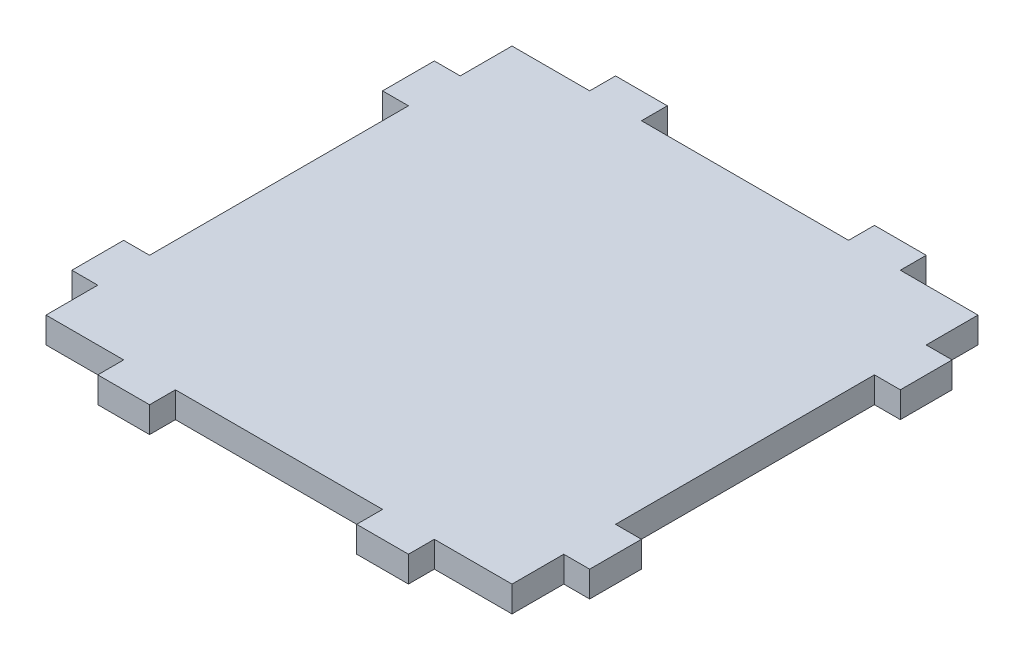
ISO-10303-21;
HEADER;
FILE_DESCRIPTION(('STEP AP214'),'2;1');
FILE_NAME('part.step','',(''),(''),'','','');
FILE_SCHEMA(('AUTOMOTIVE_DESIGN { 1 0 10303 214 1 1 1 1 }'));
ENDSEC;
DATA;
#1=APPLICATION_CONTEXT('core data for automotive mechanical design processes');
#2=APPLICATION_PROTOCOL_DEFINITION('international standard','automotive_design',2000,#1);
#3=PRODUCT_CONTEXT('',#1,'mechanical');
#4=PRODUCT('Part','Part','',(#3));
#5=PRODUCT_RELATED_PRODUCT_CATEGORY('part','',(#4));
#6=PRODUCT_DEFINITION_FORMATION('','',#4);
#7=PRODUCT_DEFINITION_CONTEXT('part definition',#1,'design');
#8=PRODUCT_DEFINITION('design','',#6,#7);
#9=PRODUCT_DEFINITION_SHAPE('','',#8);
#10=(LENGTH_UNIT() NAMED_UNIT(*) SI_UNIT(.MILLI.,.METRE.));
#11=(NAMED_UNIT(*) PLANE_ANGLE_UNIT() SI_UNIT($,.RADIAN.));
#12=(NAMED_UNIT(*) SI_UNIT($,.STERADIAN.) SOLID_ANGLE_UNIT());
#13=UNCERTAINTY_MEASURE_WITH_UNIT(LENGTH_MEASURE(1.E-05),#10,'distance_accuracy_value','');
#14=(GEOMETRIC_REPRESENTATION_CONTEXT(3) GLOBAL_UNCERTAINTY_ASSIGNED_CONTEXT((#13)) GLOBAL_UNIT_ASSIGNED_CONTEXT((#10,
#11,#12)) REPRESENTATION_CONTEXT('',''));
#15=CARTESIAN_POINT('',(0.,0.,0.));
#16=DIRECTION('',(0.,0.,1.));
#17=DIRECTION('',(1.,0.,0.));
#18=AXIS2_PLACEMENT_3D('',#15,#16,#17);
#19=CARTESIAN_POINT('',(45.,5.,45.));
#20=DIRECTION('',(-1.,0.,0.));
#21=DIRECTION('',(0.,0.,1.));
#22=AXIS2_PLACEMENT_3D('',#19,#20,#21);
#23=PLANE('',#22);
#24=DIRECTION('',(0.,0.,-1.));
#25=VECTOR('',#24,1.);
#26=CARTESIAN_POINT('',(45.,0.,45.));
#27=LINE('',#26,#25);
#28=CARTESIAN_POINT('',(45.,0.,45.));
#29=VERTEX_POINT('',#28);
#30=CARTESIAN_POINT('',(45.,0.,35.));
#31=VERTEX_POINT('',#30);
#32=EDGE_CURVE('E305',#29,#31,#27,.T.);
#33=ORIENTED_EDGE('',*,*,#32,.T.);
#34=DIRECTION('',(0.,-1.,0.));
#35=VECTOR('',#34,1.);
#36=CARTESIAN_POINT('',(45.,5.,35.));
#37=LINE('',#36,#35);
#38=CARTESIAN_POINT('',(45.,5.,35.));
#39=VERTEX_POINT('',#38);
#40=EDGE_CURVE('E11',#39,#31,#37,.T.);
#41=ORIENTED_EDGE('',*,*,#40,.F.);
#42=DIRECTION('',(0.,0.,-1.));
#43=VECTOR('',#42,1.);
#44=CARTESIAN_POINT('',(45.,5.,45.));
#45=LINE('',#44,#43);
#46=CARTESIAN_POINT('',(45.,5.,45.));
#47=VERTEX_POINT('',#46);
#48=EDGE_CURVE('E375',#47,#39,#45,.T.);
#49=ORIENTED_EDGE('',*,*,#48,.F.);
#50=DIRECTION('',(0.,-1.,0.));
#51=VECTOR('',#50,1.);
#52=CARTESIAN_POINT('',(45.,5.,45.));
#53=LINE('',#52,#51);
#54=EDGE_CURVE('E301',#47,#29,#53,.T.);
#55=ORIENTED_EDGE('',*,*,#54,.T.);
#56=EDGE_LOOP('',(#33,#41,#49,#55));
#57=FACE_BOUND('',#56,.T.);
#58=ADVANCED_FACE('F41',(#57),#23,.F.);
#59=CARTESIAN_POINT('',(45.,5.,35.));
#60=DIRECTION('',(0.,0.,-1.));
#61=DIRECTION('',(-1.,0.,0.));
#62=AXIS2_PLACEMENT_3D('',#59,#60,#61);
#63=PLANE('',#62);
#64=DIRECTION('',(1.,0.,0.));
#65=VECTOR('',#64,1.);
#66=CARTESIAN_POINT('',(45.,0.,35.));
#67=LINE('',#66,#65);
#68=CARTESIAN_POINT('',(50.,0.,35.));
#69=VERTEX_POINT('',#68);
#70=EDGE_CURVE('E308',#31,#69,#67,.T.);
#71=ORIENTED_EDGE('',*,*,#70,.T.);
#72=DIRECTION('',(0.,-1.,0.));
#73=VECTOR('',#72,1.);
#74=CARTESIAN_POINT('',(50.,5.,35.));
#75=LINE('',#74,#73);
#76=CARTESIAN_POINT('',(50.,5.,35.));
#77=VERTEX_POINT('',#76);
#78=EDGE_CURVE('E49',#77,#69,#75,.T.);
#79=ORIENTED_EDGE('',*,*,#78,.F.);
#80=DIRECTION('',(1.,0.,0.));
#81=VECTOR('',#80,1.);
#82=CARTESIAN_POINT('',(45.,5.,35.));
#83=LINE('',#82,#81);
#84=EDGE_CURVE('E184',#39,#77,#83,.T.);
#85=ORIENTED_EDGE('',*,*,#84,.F.);
#86=ORIENTED_EDGE('',*,*,#40,.T.);
#87=EDGE_LOOP('',(#71,#79,#85,#86));
#88=FACE_BOUND('',#87,.T.);
#89=ADVANCED_FACE('F573',(#88),#63,.F.);
#90=CARTESIAN_POINT('',(50.,5.,35.));
#91=DIRECTION('',(-1.,0.,0.));
#92=DIRECTION('',(0.,0.,1.));
#93=AXIS2_PLACEMENT_3D('',#90,#91,#92);
#94=PLANE('',#93);
#95=DIRECTION('',(0.,0.,-1.));
#96=VECTOR('',#95,1.);
#97=CARTESIAN_POINT('',(50.,0.,35.));
#98=LINE('',#97,#96);
#99=CARTESIAN_POINT('',(50.,0.,25.));
#100=VERTEX_POINT('',#99);
#101=EDGE_CURVE('E310',#69,#100,#98,.T.);
#102=ORIENTED_EDGE('',*,*,#101,.T.);
#103=DIRECTION('',(0.,-1.,0.));
#104=VECTOR('',#103,1.);
#105=CARTESIAN_POINT('',(50.,5.,25.));
#106=LINE('',#105,#104);
#107=CARTESIAN_POINT('',(50.,5.,25.));
#108=VERTEX_POINT('',#107);
#109=EDGE_CURVE('E466',#108,#100,#106,.T.);
#110=ORIENTED_EDGE('',*,*,#109,.F.);
#111=DIRECTION('',(0.,0.,-1.));
#112=VECTOR('',#111,1.);
#113=CARTESIAN_POINT('',(50.,5.,35.));
#114=LINE('',#113,#112);
#115=EDGE_CURVE('E474',#77,#108,#114,.T.);
#116=ORIENTED_EDGE('',*,*,#115,.F.);
#117=ORIENTED_EDGE('',*,*,#78,.T.);
#118=EDGE_LOOP('',(#102,#110,#116,#117));
#119=FACE_BOUND('',#118,.T.);
#120=ADVANCED_FACE('F472',(#119),#94,.F.);
#121=CARTESIAN_POINT('',(45.,5.,25.));
#122=DIRECTION('',(0.,0.,1.));
#123=DIRECTION('',(1.,0.,0.));
#124=AXIS2_PLACEMENT_3D('',#121,#122,#123);
#125=PLANE('',#124);
#126=DIRECTION('',(-1.,0.,0.));
#127=VECTOR('',#126,1.);
#128=CARTESIAN_POINT('',(45.,0.,25.));
#129=LINE('',#128,#127);
#130=CARTESIAN_POINT('',(45.,0.,25.));
#131=VERTEX_POINT('',#130);
#132=EDGE_CURVE('E312',#100,#131,#129,.T.);
#133=ORIENTED_EDGE('',*,*,#132,.T.);
#134=DIRECTION('',(0.,-1.,0.));
#135=VECTOR('',#134,1.);
#136=CARTESIAN_POINT('',(45.,5.,25.));
#137=LINE('',#136,#135);
#138=CARTESIAN_POINT('',(45.,5.,25.));
#139=VERTEX_POINT('',#138);
#140=EDGE_CURVE('E463',#139,#131,#137,.T.);
#141=ORIENTED_EDGE('',*,*,#140,.F.);
#142=DIRECTION('',(-1.,0.,0.));
#143=VECTOR('',#142,1.);
#144=CARTESIAN_POINT('',(45.,5.,25.));
#145=LINE('',#144,#143);
#146=EDGE_CURVE('E492',#108,#139,#145,.T.);
#147=ORIENTED_EDGE('',*,*,#146,.F.);
#148=ORIENTED_EDGE('',*,*,#109,.T.);
#149=EDGE_LOOP('',(#133,#141,#147,#148));
#150=FACE_BOUND('',#149,.T.);
#151=ADVANCED_FACE('F483',(#150),#125,.F.);
#152=CARTESIAN_POINT('',(45.,5.,-25.));
#153=DIRECTION('',(-1.,0.,0.));
#154=DIRECTION('',(0.,0.,1.));
#155=AXIS2_PLACEMENT_3D('',#152,#153,#154);
#156=PLANE('',#155);
#157=DIRECTION('',(0.,0.,-1.));
#158=VECTOR('',#157,1.);
#159=CARTESIAN_POINT('',(45.,0.,-25.));
#160=LINE('',#159,#158);
#161=CARTESIAN_POINT('',(45.,0.,-25.));
#162=VERTEX_POINT('',#161);
#163=EDGE_CURVE('E314',#131,#162,#160,.T.);
#164=ORIENTED_EDGE('',*,*,#163,.T.);
#165=DIRECTION('',(0.,-1.,0.));
#166=VECTOR('',#165,1.);
#167=CARTESIAN_POINT('',(45.,5.,-25.));
#168=LINE('',#167,#166);
#169=CARTESIAN_POINT('',(45.,5.,-25.));
#170=VERTEX_POINT('',#169);
#171=EDGE_CURVE('E460',#170,#162,#168,.T.);
#172=ORIENTED_EDGE('',*,*,#171,.F.);
#173=DIRECTION('',(0.,0.,-1.));
#174=VECTOR('',#173,1.);
#175=CARTESIAN_POINT('',(45.,5.,-25.));
#176=LINE('',#175,#174);
#177=EDGE_CURVE('E489',#139,#170,#176,.T.);
#178=ORIENTED_EDGE('',*,*,#177,.F.);
#179=ORIENTED_EDGE('',*,*,#140,.T.);
#180=EDGE_LOOP('',(#164,#172,#178,#179));
#181=FACE_BOUND('',#180,.T.);
#182=ADVANCED_FACE('F487',(#181),#156,.F.);
#183=CARTESIAN_POINT('',(45.,5.,-25.));
#184=DIRECTION('',(0.,0.,-1.));
#185=DIRECTION('',(-1.,0.,0.));
#186=AXIS2_PLACEMENT_3D('',#183,#184,#185);
#187=PLANE('',#186);
#188=DIRECTION('',(1.,0.,0.));
#189=VECTOR('',#188,1.);
#190=CARTESIAN_POINT('',(45.,0.,-25.));
#191=LINE('',#190,#189);
#192=CARTESIAN_POINT('',(50.,0.,-25.));
#193=VERTEX_POINT('',#192);
#194=EDGE_CURVE('E316',#162,#193,#191,.T.);
#195=ORIENTED_EDGE('',*,*,#194,.T.);
#196=DIRECTION('',(0.,-1.,0.));
#197=VECTOR('',#196,1.);
#198=CARTESIAN_POINT('',(50.,5.,-25.));
#199=LINE('',#198,#197);
#200=CARTESIAN_POINT('',(50.,5.,-25.));
#201=VERTEX_POINT('',#200);
#202=EDGE_CURVE('E457',#201,#193,#199,.T.);
#203=ORIENTED_EDGE('',*,*,#202,.F.);
#204=DIRECTION('',(1.,0.,0.));
#205=VECTOR('',#204,1.);
#206=CARTESIAN_POINT('',(45.,5.,-25.));
#207=LINE('',#206,#205);
#208=EDGE_CURVE('E491',#170,#201,#207,.T.);
#209=ORIENTED_EDGE('',*,*,#208,.F.);
#210=ORIENTED_EDGE('',*,*,#171,.T.);
#211=EDGE_LOOP('',(#195,#203,#209,#210));
#212=FACE_BOUND('',#211,.T.);
#213=ADVANCED_FACE('F586',(#212),#187,.F.);
#214=CARTESIAN_POINT('',(50.,5.,-35.));
#215=DIRECTION('',(-1.,0.,0.));
#216=DIRECTION('',(0.,0.,1.));
#217=AXIS2_PLACEMENT_3D('',#214,#215,#216);
#218=PLANE('',#217);
#219=DIRECTION('',(0.,0.,-1.));
#220=VECTOR('',#219,1.);
#221=CARTESIAN_POINT('',(50.,0.,-35.));
#222=LINE('',#221,#220);
#223=CARTESIAN_POINT('',(50.,0.,-35.));
#224=VERTEX_POINT('',#223);
#225=EDGE_CURVE('E318',#193,#224,#222,.T.);
#226=ORIENTED_EDGE('',*,*,#225,.T.);
#227=DIRECTION('',(0.,-1.,0.));
#228=VECTOR('',#227,1.);
#229=CARTESIAN_POINT('',(50.,5.,-35.));
#230=LINE('',#229,#228);
#231=CARTESIAN_POINT('',(50.,5.,-35.));
#232=VERTEX_POINT('',#231);
#233=EDGE_CURVE('E454',#232,#224,#230,.T.);
#234=ORIENTED_EDGE('',*,*,#233,.F.);
#235=DIRECTION('',(0.,0.,-1.));
#236=VECTOR('',#235,1.);
#237=CARTESIAN_POINT('',(50.,5.,-35.));
#238=LINE('',#237,#236);
#239=EDGE_CURVE('E494',#201,#232,#238,.T.);
#240=ORIENTED_EDGE('',*,*,#239,.F.);
#241=ORIENTED_EDGE('',*,*,#202,.T.);
#242=EDGE_LOOP('',(#226,#234,#240,#241));
#243=FACE_BOUND('',#242,.T.);
#244=ADVANCED_FACE('F589',(#243),#218,.F.);
#245=CARTESIAN_POINT('',(45.,5.,-35.));
#246=DIRECTION('',(0.,0.,1.));
#247=DIRECTION('',(1.,0.,0.));
#248=AXIS2_PLACEMENT_3D('',#245,#246,#247);
#249=PLANE('',#248);
#250=DIRECTION('',(-1.,0.,0.));
#251=VECTOR('',#250,1.);
#252=CARTESIAN_POINT('',(45.,0.,-35.));
#253=LINE('',#252,#251);
#254=CARTESIAN_POINT('',(45.,0.,-35.));
#255=VERTEX_POINT('',#254);
#256=EDGE_CURVE('E320',#224,#255,#253,.T.);
#257=ORIENTED_EDGE('',*,*,#256,.T.);
#258=DIRECTION('',(0.,-1.,0.));
#259=VECTOR('',#258,1.);
#260=CARTESIAN_POINT('',(45.,5.,-35.));
#261=LINE('',#260,#259);
#262=CARTESIAN_POINT('',(45.,5.,-35.));
#263=VERTEX_POINT('',#262);
#264=EDGE_CURVE('E451',#263,#255,#261,.T.);
#265=ORIENTED_EDGE('',*,*,#264,.F.);
#266=DIRECTION('',(-1.,0.,0.));
#267=VECTOR('',#266,1.);
#268=CARTESIAN_POINT('',(45.,5.,-35.));
#269=LINE('',#268,#267);
#270=EDGE_CURVE('E500',#232,#263,#269,.T.);
#271=ORIENTED_EDGE('',*,*,#270,.F.);
#272=ORIENTED_EDGE('',*,*,#233,.T.);
#273=EDGE_LOOP('',(#257,#265,#271,#272));
#274=FACE_BOUND('',#273,.T.);
#275=ADVANCED_FACE('F593',(#274),#249,.F.);
#276=CARTESIAN_POINT('',(45.,5.,-45.));
#277=DIRECTION('',(-1.,0.,0.));
#278=DIRECTION('',(0.,0.,1.));
#279=AXIS2_PLACEMENT_3D('',#276,#277,#278);
#280=PLANE('',#279);
#281=DIRECTION('',(0.,0.,-1.));
#282=VECTOR('',#281,1.);
#283=CARTESIAN_POINT('',(45.,0.,-45.));
#284=LINE('',#283,#282);
#285=CARTESIAN_POINT('',(45.,0.,-45.));
#286=VERTEX_POINT('',#285);
#287=EDGE_CURVE('E322',#255,#286,#284,.T.);
#288=ORIENTED_EDGE('',*,*,#287,.T.);
#289=DIRECTION('',(0.,-1.,0.));
#290=VECTOR('',#289,1.);
#291=CARTESIAN_POINT('',(45.,5.,-45.));
#292=LINE('',#291,#290);
#293=CARTESIAN_POINT('',(45.,5.,-45.));
#294=VERTEX_POINT('',#293);
#295=EDGE_CURVE('E448',#294,#286,#292,.T.);
#296=ORIENTED_EDGE('',*,*,#295,.F.);
#297=DIRECTION('',(0.,0.,-1.));
#298=VECTOR('',#297,1.);
#299=CARTESIAN_POINT('',(45.,5.,-45.));
#300=LINE('',#299,#298);
#301=EDGE_CURVE('E502',#263,#294,#300,.T.);
#302=ORIENTED_EDGE('',*,*,#301,.F.);
#303=ORIENTED_EDGE('',*,*,#264,.T.);
#304=EDGE_LOOP('',(#288,#296,#302,#303));
#305=FACE_BOUND('',#304,.T.);
#306=ADVANCED_FACE('F597',(#305),#280,.F.);
#307=CARTESIAN_POINT('',(45.,5.,-45.));
#308=DIRECTION('',(0.,0.,1.));
#309=DIRECTION('',(1.,0.,0.));
#310=AXIS2_PLACEMENT_3D('',#307,#308,#309);
#311=PLANE('',#310);
#312=DIRECTION('',(-1.,0.,0.));
#313=VECTOR('',#312,1.);
#314=CARTESIAN_POINT('',(45.,0.,-45.));
#315=LINE('',#314,#313);
#316=CARTESIAN_POINT('',(30.,0.,-45.));
#317=VERTEX_POINT('',#316);
#318=EDGE_CURVE('E324',#286,#317,#315,.T.);
#319=ORIENTED_EDGE('',*,*,#318,.T.);
#320=DIRECTION('',(0.,-1.,0.));
#321=VECTOR('',#320,1.);
#322=CARTESIAN_POINT('',(30.,5.,-45.));
#323=LINE('',#322,#321);
#324=CARTESIAN_POINT('',(30.,5.,-45.));
#325=VERTEX_POINT('',#324);
#326=EDGE_CURVE('E445',#325,#317,#323,.T.);
#327=ORIENTED_EDGE('',*,*,#326,.F.);
#328=DIRECTION('',(-1.,0.,0.));
#329=VECTOR('',#328,1.);
#330=CARTESIAN_POINT('',(45.,5.,-45.));
#331=LINE('',#330,#329);
#332=EDGE_CURVE('E504',#294,#325,#331,.T.);
#333=ORIENTED_EDGE('',*,*,#332,.F.);
#334=ORIENTED_EDGE('',*,*,#295,.T.);
#335=EDGE_LOOP('',(#319,#327,#333,#334));
#336=FACE_BOUND('',#335,.T.);
#337=ADVANCED_FACE('F601',(#336),#311,.F.);
#338=CARTESIAN_POINT('',(30.,5.,-45.));
#339=DIRECTION('',(-1.,0.,0.));
#340=DIRECTION('',(0.,0.,1.));
#341=AXIS2_PLACEMENT_3D('',#338,#339,#340);
#342=PLANE('',#341);
#343=DIRECTION('',(0.,0.,-1.));
#344=VECTOR('',#343,1.);
#345=CARTESIAN_POINT('',(30.,0.,-45.));
#346=LINE('',#345,#344);
#347=CARTESIAN_POINT('',(30.,0.,-50.));
#348=VERTEX_POINT('',#347);
#349=EDGE_CURVE('E326',#317,#348,#346,.T.);
#350=ORIENTED_EDGE('',*,*,#349,.T.);
#351=DIRECTION('',(0.,-1.,0.));
#352=VECTOR('',#351,1.);
#353=CARTESIAN_POINT('',(30.,5.,-50.));
#354=LINE('',#353,#352);
#355=CARTESIAN_POINT('',(30.,5.,-50.));
#356=VERTEX_POINT('',#355);
#357=EDGE_CURVE('E442',#356,#348,#354,.T.);
#358=ORIENTED_EDGE('',*,*,#357,.F.);
#359=DIRECTION('',(0.,0.,-1.));
#360=VECTOR('',#359,1.);
#361=CARTESIAN_POINT('',(30.,5.,-45.));
#362=LINE('',#361,#360);
#363=EDGE_CURVE('E506',#325,#356,#362,.T.);
#364=ORIENTED_EDGE('',*,*,#363,.F.);
#365=ORIENTED_EDGE('',*,*,#326,.T.);
#366=EDGE_LOOP('',(#350,#358,#364,#365));
#367=FACE_BOUND('',#366,.T.);
#368=ADVANCED_FACE('F605',(#367),#342,.F.);
#369=CARTESIAN_POINT('',(30.,5.,-50.));
#370=DIRECTION('',(0.,0.,1.));
#371=DIRECTION('',(1.,0.,0.));
#372=AXIS2_PLACEMENT_3D('',#369,#370,#371);
#373=PLANE('',#372);
#374=DIRECTION('',(-1.,0.,0.));
#375=VECTOR('',#374,1.);
#376=CARTESIAN_POINT('',(30.,0.,-50.));
#377=LINE('',#376,#375);
#378=CARTESIAN_POINT('',(20.,0.,-50.));
#379=VERTEX_POINT('',#378);
#380=EDGE_CURVE('E328',#348,#379,#377,.T.);
#381=ORIENTED_EDGE('',*,*,#380,.T.);
#382=DIRECTION('',(0.,-1.,0.));
#383=VECTOR('',#382,1.);
#384=CARTESIAN_POINT('',(20.,5.,-50.));
#385=LINE('',#384,#383);
#386=CARTESIAN_POINT('',(20.,5.,-50.));
#387=VERTEX_POINT('',#386);
#388=EDGE_CURVE('E439',#387,#379,#385,.T.);
#389=ORIENTED_EDGE('',*,*,#388,.F.);
#390=DIRECTION('',(-1.,0.,0.));
#391=VECTOR('',#390,1.);
#392=CARTESIAN_POINT('',(30.,5.,-50.));
#393=LINE('',#392,#391);
#394=EDGE_CURVE('E508',#356,#387,#393,.T.);
#395=ORIENTED_EDGE('',*,*,#394,.F.);
#396=ORIENTED_EDGE('',*,*,#357,.T.);
#397=EDGE_LOOP('',(#381,#389,#395,#396));
#398=FACE_BOUND('',#397,.T.);
#399=ADVANCED_FACE('F609',(#398),#373,.F.);
#400=CARTESIAN_POINT('',(20.,5.,-45.));
#401=DIRECTION('',(1.,0.,0.));
#402=DIRECTION('',(0.,0.,-1.));
#403=AXIS2_PLACEMENT_3D('',#400,#401,#402);
#404=PLANE('',#403);
#405=DIRECTION('',(0.,0.,1.));
#406=VECTOR('',#405,1.);
#407=CARTESIAN_POINT('',(20.,0.,-45.));
#408=LINE('',#407,#406);
#409=CARTESIAN_POINT('',(20.,0.,-45.));
#410=VERTEX_POINT('',#409);
#411=EDGE_CURVE('E330',#379,#410,#408,.T.);
#412=ORIENTED_EDGE('',*,*,#411,.T.);
#413=DIRECTION('',(0.,-1.,0.));
#414=VECTOR('',#413,1.);
#415=CARTESIAN_POINT('',(20.,5.,-45.));
#416=LINE('',#415,#414);
#417=CARTESIAN_POINT('',(20.,5.,-45.));
#418=VERTEX_POINT('',#417);
#419=EDGE_CURVE('E436',#418,#410,#416,.T.);
#420=ORIENTED_EDGE('',*,*,#419,.F.);
#421=DIRECTION('',(0.,0.,1.));
#422=VECTOR('',#421,1.);
#423=CARTESIAN_POINT('',(20.,5.,-45.));
#424=LINE('',#423,#422);
#425=EDGE_CURVE('E510',#387,#418,#424,.T.);
#426=ORIENTED_EDGE('',*,*,#425,.F.);
#427=ORIENTED_EDGE('',*,*,#388,.T.);
#428=EDGE_LOOP('',(#412,#420,#426,#427));
#429=FACE_BOUND('',#428,.T.);
#430=ADVANCED_FACE('F613',(#429),#404,.F.);
#431=CARTESIAN_POINT('',(-20.,5.,-45.));
#432=DIRECTION('',(0.,0.,1.));
#433=DIRECTION('',(1.,0.,0.));
#434=AXIS2_PLACEMENT_3D('',#431,#432,#433);
#435=PLANE('',#434);
#436=DIRECTION('',(-1.,0.,0.));
#437=VECTOR('',#436,1.);
#438=CARTESIAN_POINT('',(-20.,0.,-45.));
#439=LINE('',#438,#437);
#440=CARTESIAN_POINT('',(-20.,0.,-45.));
#441=VERTEX_POINT('',#440);
#442=EDGE_CURVE('E332',#410,#441,#439,.T.);
#443=ORIENTED_EDGE('',*,*,#442,.T.);
#444=DIRECTION('',(0.,-1.,0.));
#445=VECTOR('',#444,1.);
#446=CARTESIAN_POINT('',(-20.,5.,-45.));
#447=LINE('',#446,#445);
#448=CARTESIAN_POINT('',(-20.,5.,-45.));
#449=VERTEX_POINT('',#448);
#450=EDGE_CURVE('E433',#449,#441,#447,.T.);
#451=ORIENTED_EDGE('',*,*,#450,.F.);
#452=DIRECTION('',(-1.,0.,0.));
#453=VECTOR('',#452,1.);
#454=CARTESIAN_POINT('',(-20.,5.,-45.));
#455=LINE('',#454,#453);
#456=EDGE_CURVE('E512',#418,#449,#455,.T.);
#457=ORIENTED_EDGE('',*,*,#456,.F.);
#458=ORIENTED_EDGE('',*,*,#419,.T.);
#459=EDGE_LOOP('',(#443,#451,#457,#458));
#460=FACE_BOUND('',#459,.T.);
#461=ADVANCED_FACE('F617',(#460),#435,.F.);
#462=CARTESIAN_POINT('',(-20.,5.,-45.));
#463=DIRECTION('',(-1.,0.,0.));
#464=DIRECTION('',(0.,0.,1.));
#465=AXIS2_PLACEMENT_3D('',#462,#463,#464);
#466=PLANE('',#465);
#467=DIRECTION('',(0.,0.,-1.));
#468=VECTOR('',#467,1.);
#469=CARTESIAN_POINT('',(-20.,0.,-45.));
#470=LINE('',#469,#468);
#471=CARTESIAN_POINT('',(-20.,0.,-50.));
#472=VERTEX_POINT('',#471);
#473=EDGE_CURVE('E334',#441,#472,#470,.T.);
#474=ORIENTED_EDGE('',*,*,#473,.T.);
#475=DIRECTION('',(0.,-1.,0.));
#476=VECTOR('',#475,1.);
#477=CARTESIAN_POINT('',(-20.,5.,-50.));
#478=LINE('',#477,#476);
#479=CARTESIAN_POINT('',(-20.,5.,-50.));
#480=VERTEX_POINT('',#479);
#481=EDGE_CURVE('E430',#480,#472,#478,.T.);
#482=ORIENTED_EDGE('',*,*,#481,.F.);
#483=DIRECTION('',(0.,0.,-1.));
#484=VECTOR('',#483,1.);
#485=CARTESIAN_POINT('',(-20.,5.,-45.));
#486=LINE('',#485,#484);
#487=EDGE_CURVE('E514',#449,#480,#486,.T.);
#488=ORIENTED_EDGE('',*,*,#487,.F.);
#489=ORIENTED_EDGE('',*,*,#450,.T.);
#490=EDGE_LOOP('',(#474,#482,#488,#489));
#491=FACE_BOUND('',#490,.T.);
#492=ADVANCED_FACE('F621',(#491),#466,.F.);
#493=CARTESIAN_POINT('',(-30.,5.,-50.));
#494=DIRECTION('',(0.,0.,1.));
#495=DIRECTION('',(1.,0.,0.));
#496=AXIS2_PLACEMENT_3D('',#493,#494,#495);
#497=PLANE('',#496);
#498=DIRECTION('',(-1.,0.,0.));
#499=VECTOR('',#498,1.);
#500=CARTESIAN_POINT('',(-30.,0.,-50.));
#501=LINE('',#500,#499);
#502=CARTESIAN_POINT('',(-30.,0.,-50.));
#503=VERTEX_POINT('',#502);
#504=EDGE_CURVE('E336',#472,#503,#501,.T.);
#505=ORIENTED_EDGE('',*,*,#504,.T.);
#506=DIRECTION('',(0.,-1.,0.));
#507=VECTOR('',#506,1.);
#508=CARTESIAN_POINT('',(-30.,5.,-50.));
#509=LINE('',#508,#507);
#510=CARTESIAN_POINT('',(-30.,5.,-50.));
#511=VERTEX_POINT('',#510);
#512=EDGE_CURVE('E427',#511,#503,#509,.T.);
#513=ORIENTED_EDGE('',*,*,#512,.F.);
#514=DIRECTION('',(-1.,0.,0.));
#515=VECTOR('',#514,1.);
#516=CARTESIAN_POINT('',(-30.,5.,-50.));
#517=LINE('',#516,#515);
#518=EDGE_CURVE('E516',#480,#511,#517,.T.);
#519=ORIENTED_EDGE('',*,*,#518,.F.);
#520=ORIENTED_EDGE('',*,*,#481,.T.);
#521=EDGE_LOOP('',(#505,#513,#519,#520));
#522=FACE_BOUND('',#521,.T.);
#523=ADVANCED_FACE('F625',(#522),#497,.F.);
#524=CARTESIAN_POINT('',(-30.,5.,-45.));
#525=DIRECTION('',(1.,0.,0.));
#526=DIRECTION('',(0.,0.,-1.));
#527=AXIS2_PLACEMENT_3D('',#524,#525,#526);
#528=PLANE('',#527);
#529=DIRECTION('',(0.,0.,1.));
#530=VECTOR('',#529,1.);
#531=CARTESIAN_POINT('',(-30.,0.,-45.));
#532=LINE('',#531,#530);
#533=CARTESIAN_POINT('',(-30.,0.,-45.));
#534=VERTEX_POINT('',#533);
#535=EDGE_CURVE('E338',#503,#534,#532,.T.);
#536=ORIENTED_EDGE('',*,*,#535,.T.);
#537=DIRECTION('',(0.,-1.,0.));
#538=VECTOR('',#537,1.);
#539=CARTESIAN_POINT('',(-30.,5.,-45.));
#540=LINE('',#539,#538);
#541=CARTESIAN_POINT('',(-30.,5.,-45.));
#542=VERTEX_POINT('',#541);
#543=EDGE_CURVE('E424',#542,#534,#540,.T.);
#544=ORIENTED_EDGE('',*,*,#543,.F.);
#545=DIRECTION('',(0.,0.,1.));
#546=VECTOR('',#545,1.);
#547=CARTESIAN_POINT('',(-30.,5.,-45.));
#548=LINE('',#547,#546);
#549=EDGE_CURVE('E518',#511,#542,#548,.T.);
#550=ORIENTED_EDGE('',*,*,#549,.F.);
#551=ORIENTED_EDGE('',*,*,#512,.T.);
#552=EDGE_LOOP('',(#536,#544,#550,#551));
#553=FACE_BOUND('',#552,.T.);
#554=ADVANCED_FACE('F629',(#553),#528,.F.);
#555=CARTESIAN_POINT('',(-45.,5.,-45.));
#556=DIRECTION('',(0.,0.,1.));
#557=DIRECTION('',(1.,0.,0.));
#558=AXIS2_PLACEMENT_3D('',#555,#556,#557);
#559=PLANE('',#558);
#560=DIRECTION('',(-1.,0.,0.));
#561=VECTOR('',#560,1.);
#562=CARTESIAN_POINT('',(-45.,0.,-45.));
#563=LINE('',#562,#561);
#564=CARTESIAN_POINT('',(-45.,0.,-45.));
#565=VERTEX_POINT('',#564);
#566=EDGE_CURVE('E340',#534,#565,#563,.T.);
#567=ORIENTED_EDGE('',*,*,#566,.T.);
#568=DIRECTION('',(0.,-1.,0.));
#569=VECTOR('',#568,1.);
#570=CARTESIAN_POINT('',(-45.,5.,-45.));
#571=LINE('',#570,#569);
#572=CARTESIAN_POINT('',(-45.,5.,-45.));
#573=VERTEX_POINT('',#572);
#574=EDGE_CURVE('E421',#573,#565,#571,.T.);
#575=ORIENTED_EDGE('',*,*,#574,.F.);
#576=DIRECTION('',(-1.,0.,0.));
#577=VECTOR('',#576,1.);
#578=CARTESIAN_POINT('',(-45.,5.,-45.));
#579=LINE('',#578,#577);
#580=EDGE_CURVE('E520',#542,#573,#579,.T.);
#581=ORIENTED_EDGE('',*,*,#580,.F.);
#582=ORIENTED_EDGE('',*,*,#543,.T.);
#583=EDGE_LOOP('',(#567,#575,#581,#582));
#584=FACE_BOUND('',#583,.T.);
#585=ADVANCED_FACE('F633',(#584),#559,.F.);
#586=CARTESIAN_POINT('',(-45.,5.,-45.));
#587=DIRECTION('',(1.,0.,0.));
#588=DIRECTION('',(0.,0.,-1.));
#589=AXIS2_PLACEMENT_3D('',#586,#587,#588);
#590=PLANE('',#589);
#591=DIRECTION('',(0.,0.,1.));
#592=VECTOR('',#591,1.);
#593=CARTESIAN_POINT('',(-45.,0.,-45.));
#594=LINE('',#593,#592);
#595=CARTESIAN_POINT('',(-45.,0.,-35.));
#596=VERTEX_POINT('',#595);
#597=EDGE_CURVE('E342',#565,#596,#594,.T.);
#598=ORIENTED_EDGE('',*,*,#597,.T.);
#599=DIRECTION('',(0.,-1.,0.));
#600=VECTOR('',#599,1.);
#601=CARTESIAN_POINT('',(-45.,5.,-35.));
#602=LINE('',#601,#600);
#603=CARTESIAN_POINT('',(-45.,5.,-35.));
#604=VERTEX_POINT('',#603);
#605=EDGE_CURVE('E418',#604,#596,#602,.T.);
#606=ORIENTED_EDGE('',*,*,#605,.F.);
#607=DIRECTION('',(0.,0.,1.));
#608=VECTOR('',#607,1.);
#609=CARTESIAN_POINT('',(-45.,5.,-45.));
#610=LINE('',#609,#608);
#611=EDGE_CURVE('E522',#573,#604,#610,.T.);
#612=ORIENTED_EDGE('',*,*,#611,.F.);
#613=ORIENTED_EDGE('',*,*,#574,.T.);
#614=EDGE_LOOP('',(#598,#606,#612,#613));
#615=FACE_BOUND('',#614,.T.);
#616=ADVANCED_FACE('F637',(#615),#590,.F.);
#617=CARTESIAN_POINT('',(-45.,5.,-35.));
#618=DIRECTION('',(0.,0.,1.));
#619=DIRECTION('',(1.,0.,0.));
#620=AXIS2_PLACEMENT_3D('',#617,#618,#619);
#621=PLANE('',#620);
#622=DIRECTION('',(-1.,0.,0.));
#623=VECTOR('',#622,1.);
#624=CARTESIAN_POINT('',(-45.,0.,-35.));
#625=LINE('',#624,#623);
#626=CARTESIAN_POINT('',(-50.,0.,-35.));
#627=VERTEX_POINT('',#626);
#628=EDGE_CURVE('E344',#596,#627,#625,.T.);
#629=ORIENTED_EDGE('',*,*,#628,.T.);
#630=DIRECTION('',(0.,-1.,0.));
#631=VECTOR('',#630,1.);
#632=CARTESIAN_POINT('',(-50.,5.,-35.));
#633=LINE('',#632,#631);
#634=CARTESIAN_POINT('',(-50.,5.,-35.));
#635=VERTEX_POINT('',#634);
#636=EDGE_CURVE('E415',#635,#627,#633,.T.);
#637=ORIENTED_EDGE('',*,*,#636,.F.);
#638=DIRECTION('',(-1.,0.,0.));
#639=VECTOR('',#638,1.);
#640=CARTESIAN_POINT('',(-45.,5.,-35.));
#641=LINE('',#640,#639);
#642=EDGE_CURVE('E524',#604,#635,#641,.T.);
#643=ORIENTED_EDGE('',*,*,#642,.F.);
#644=ORIENTED_EDGE('',*,*,#605,.T.);
#645=EDGE_LOOP('',(#629,#637,#643,#644));
#646=FACE_BOUND('',#645,.T.);
#647=ADVANCED_FACE('F641',(#646),#621,.F.);
#648=CARTESIAN_POINT('',(-50.,5.,-35.));
#649=DIRECTION('',(1.,0.,0.));
#650=DIRECTION('',(0.,0.,-1.));
#651=AXIS2_PLACEMENT_3D('',#648,#649,#650);
#652=PLANE('',#651);
#653=DIRECTION('',(0.,0.,1.));
#654=VECTOR('',#653,1.);
#655=CARTESIAN_POINT('',(-50.,0.,-35.));
#656=LINE('',#655,#654);
#657=CARTESIAN_POINT('',(-50.,0.,-25.));
#658=VERTEX_POINT('',#657);
#659=EDGE_CURVE('E346',#627,#658,#656,.T.);
#660=ORIENTED_EDGE('',*,*,#659,.T.);
#661=DIRECTION('',(0.,-1.,0.));
#662=VECTOR('',#661,1.);
#663=CARTESIAN_POINT('',(-50.,5.,-25.));
#664=LINE('',#663,#662);
#665=CARTESIAN_POINT('',(-50.,5.,-25.));
#666=VERTEX_POINT('',#665);
#667=EDGE_CURVE('E412',#666,#658,#664,.T.);
#668=ORIENTED_EDGE('',*,*,#667,.F.);
#669=DIRECTION('',(0.,0.,1.));
#670=VECTOR('',#669,1.);
#671=CARTESIAN_POINT('',(-50.,5.,-35.));
#672=LINE('',#671,#670);
#673=EDGE_CURVE('E526',#635,#666,#672,.T.);
#674=ORIENTED_EDGE('',*,*,#673,.F.);
#675=ORIENTED_EDGE('',*,*,#636,.T.);
#676=EDGE_LOOP('',(#660,#668,#674,#675));
#677=FACE_BOUND('',#676,.T.);
#678=ADVANCED_FACE('F645',(#677),#652,.F.);
#679=CARTESIAN_POINT('',(-45.,5.,-25.));
#680=DIRECTION('',(0.,0.,-1.));
#681=DIRECTION('',(-1.,0.,0.));
#682=AXIS2_PLACEMENT_3D('',#679,#680,#681);
#683=PLANE('',#682);
#684=DIRECTION('',(1.,0.,0.));
#685=VECTOR('',#684,1.);
#686=CARTESIAN_POINT('',(-45.,0.,-25.));
#687=LINE('',#686,#685);
#688=CARTESIAN_POINT('',(-45.,0.,-25.));
#689=VERTEX_POINT('',#688);
#690=EDGE_CURVE('E348',#658,#689,#687,.T.);
#691=ORIENTED_EDGE('',*,*,#690,.T.);
#692=DIRECTION('',(0.,-1.,0.));
#693=VECTOR('',#692,1.);
#694=CARTESIAN_POINT('',(-45.,5.,-25.));
#695=LINE('',#694,#693);
#696=CARTESIAN_POINT('',(-45.,5.,-25.));
#697=VERTEX_POINT('',#696);
#698=EDGE_CURVE('E409',#697,#689,#695,.T.);
#699=ORIENTED_EDGE('',*,*,#698,.F.);
#700=DIRECTION('',(1.,0.,0.));
#701=VECTOR('',#700,1.);
#702=CARTESIAN_POINT('',(-45.,5.,-25.));
#703=LINE('',#702,#701);
#704=EDGE_CURVE('E528',#666,#697,#703,.T.);
#705=ORIENTED_EDGE('',*,*,#704,.F.);
#706=ORIENTED_EDGE('',*,*,#667,.T.);
#707=EDGE_LOOP('',(#691,#699,#705,#706));
#708=FACE_BOUND('',#707,.T.);
#709=ADVANCED_FACE('F649',(#708),#683,.F.);
#710=CARTESIAN_POINT('',(-45.,5.,-25.));
#711=DIRECTION('',(1.,0.,0.));
#712=DIRECTION('',(0.,0.,-1.));
#713=AXIS2_PLACEMENT_3D('',#710,#711,#712);
#714=PLANE('',#713);
#715=DIRECTION('',(0.,0.,1.));
#716=VECTOR('',#715,1.);
#717=CARTESIAN_POINT('',(-45.,0.,-25.));
#718=LINE('',#717,#716);
#719=CARTESIAN_POINT('',(-45.,0.,25.));
#720=VERTEX_POINT('',#719);
#721=EDGE_CURVE('E350',#689,#720,#718,.T.);
#722=ORIENTED_EDGE('',*,*,#721,.T.);
#723=DIRECTION('',(0.,-1.,0.));
#724=VECTOR('',#723,1.);
#725=CARTESIAN_POINT('',(-45.,5.,25.));
#726=LINE('',#725,#724);
#727=CARTESIAN_POINT('',(-45.,5.,25.));
#728=VERTEX_POINT('',#727);
#729=EDGE_CURVE('E406',#728,#720,#726,.T.);
#730=ORIENTED_EDGE('',*,*,#729,.F.);
#731=DIRECTION('',(0.,0.,1.));
#732=VECTOR('',#731,1.);
#733=CARTESIAN_POINT('',(-45.,5.,-25.));
#734=LINE('',#733,#732);
#735=EDGE_CURVE('E530',#697,#728,#734,.T.);
#736=ORIENTED_EDGE('',*,*,#735,.F.);
#737=ORIENTED_EDGE('',*,*,#698,.T.);
#738=EDGE_LOOP('',(#722,#730,#736,#737));
#739=FACE_BOUND('',#738,.T.);
#740=ADVANCED_FACE('F653',(#739),#714,.F.);
#741=CARTESIAN_POINT('',(-45.,5.,25.));
#742=DIRECTION('',(0.,0.,1.));
#743=DIRECTION('',(1.,0.,0.));
#744=AXIS2_PLACEMENT_3D('',#741,#742,#743);
#745=PLANE('',#744);
#746=DIRECTION('',(-1.,0.,0.));
#747=VECTOR('',#746,1.);
#748=CARTESIAN_POINT('',(-45.,0.,25.));
#749=LINE('',#748,#747);
#750=CARTESIAN_POINT('',(-50.,0.,25.));
#751=VERTEX_POINT('',#750);
#752=EDGE_CURVE('E352',#720,#751,#749,.T.);
#753=ORIENTED_EDGE('',*,*,#752,.T.);
#754=DIRECTION('',(0.,-1.,0.));
#755=VECTOR('',#754,1.);
#756=CARTESIAN_POINT('',(-50.,5.,25.));
#757=LINE('',#756,#755);
#758=CARTESIAN_POINT('',(-50.,5.,25.));
#759=VERTEX_POINT('',#758);
#760=EDGE_CURVE('E403',#759,#751,#757,.T.);
#761=ORIENTED_EDGE('',*,*,#760,.F.);
#762=DIRECTION('',(-1.,0.,0.));
#763=VECTOR('',#762,1.);
#764=CARTESIAN_POINT('',(-45.,5.,25.));
#765=LINE('',#764,#763);
#766=EDGE_CURVE('E532',#728,#759,#765,.T.);
#767=ORIENTED_EDGE('',*,*,#766,.F.);
#768=ORIENTED_EDGE('',*,*,#729,.T.);
#769=EDGE_LOOP('',(#753,#761,#767,#768));
#770=FACE_BOUND('',#769,.T.);
#771=ADVANCED_FACE('F657',(#770),#745,.F.);
#772=CARTESIAN_POINT('',(-50.,5.,35.));
#773=DIRECTION('',(1.,0.,0.));
#774=DIRECTION('',(0.,0.,-1.));
#775=AXIS2_PLACEMENT_3D('',#772,#773,#774);
#776=PLANE('',#775);
#777=DIRECTION('',(0.,0.,1.));
#778=VECTOR('',#777,1.);
#779=CARTESIAN_POINT('',(-50.,0.,35.));
#780=LINE('',#779,#778);
#781=CARTESIAN_POINT('',(-50.,0.,35.));
#782=VERTEX_POINT('',#781);
#783=EDGE_CURVE('E354',#751,#782,#780,.T.);
#784=ORIENTED_EDGE('',*,*,#783,.T.);
#785=DIRECTION('',(0.,-1.,0.));
#786=VECTOR('',#785,1.);
#787=CARTESIAN_POINT('',(-50.,5.,35.));
#788=LINE('',#787,#786);
#789=CARTESIAN_POINT('',(-50.,5.,35.));
#790=VERTEX_POINT('',#789);
#791=EDGE_CURVE('E400',#790,#782,#788,.T.);
#792=ORIENTED_EDGE('',*,*,#791,.F.);
#793=DIRECTION('',(0.,0.,1.));
#794=VECTOR('',#793,1.);
#795=CARTESIAN_POINT('',(-50.,5.,35.));
#796=LINE('',#795,#794);
#797=EDGE_CURVE('E534',#759,#790,#796,.T.);
#798=ORIENTED_EDGE('',*,*,#797,.F.);
#799=ORIENTED_EDGE('',*,*,#760,.T.);
#800=EDGE_LOOP('',(#784,#792,#798,#799));
#801=FACE_BOUND('',#800,.T.);
#802=ADVANCED_FACE('F661',(#801),#776,.F.);
#803=CARTESIAN_POINT('',(-45.,5.,35.));
#804=DIRECTION('',(0.,0.,-1.));
#805=DIRECTION('',(-1.,0.,0.));
#806=AXIS2_PLACEMENT_3D('',#803,#804,#805);
#807=PLANE('',#806);
#808=DIRECTION('',(1.,0.,0.));
#809=VECTOR('',#808,1.);
#810=CARTESIAN_POINT('',(-45.,0.,35.));
#811=LINE('',#810,#809);
#812=CARTESIAN_POINT('',(-45.,0.,35.));
#813=VERTEX_POINT('',#812);
#814=EDGE_CURVE('E356',#782,#813,#811,.T.);
#815=ORIENTED_EDGE('',*,*,#814,.T.);
#816=DIRECTION('',(0.,-1.,0.));
#817=VECTOR('',#816,1.);
#818=CARTESIAN_POINT('',(-45.,5.,35.));
#819=LINE('',#818,#817);
#820=CARTESIAN_POINT('',(-45.,5.,35.));
#821=VERTEX_POINT('',#820);
#822=EDGE_CURVE('E397',#821,#813,#819,.T.);
#823=ORIENTED_EDGE('',*,*,#822,.F.);
#824=DIRECTION('',(1.,0.,0.));
#825=VECTOR('',#824,1.);
#826=CARTESIAN_POINT('',(-45.,5.,35.));
#827=LINE('',#826,#825);
#828=EDGE_CURVE('E536',#790,#821,#827,.T.);
#829=ORIENTED_EDGE('',*,*,#828,.F.);
#830=ORIENTED_EDGE('',*,*,#791,.T.);
#831=EDGE_LOOP('',(#815,#823,#829,#830));
#832=FACE_BOUND('',#831,.T.);
#833=ADVANCED_FACE('F665',(#832),#807,.F.);
#834=CARTESIAN_POINT('',(-45.,5.,45.));
#835=DIRECTION('',(1.,0.,0.));
#836=DIRECTION('',(0.,0.,-1.));
#837=AXIS2_PLACEMENT_3D('',#834,#835,#836);
#838=PLANE('',#837);
#839=DIRECTION('',(0.,0.,1.));
#840=VECTOR('',#839,1.);
#841=CARTESIAN_POINT('',(-45.,0.,45.));
#842=LINE('',#841,#840);
#843=CARTESIAN_POINT('',(-45.,0.,45.));
#844=VERTEX_POINT('',#843);
#845=EDGE_CURVE('E358',#813,#844,#842,.T.);
#846=ORIENTED_EDGE('',*,*,#845,.T.);
#847=DIRECTION('',(0.,-1.,0.));
#848=VECTOR('',#847,1.);
#849=CARTESIAN_POINT('',(-45.,5.,45.));
#850=LINE('',#849,#848);
#851=CARTESIAN_POINT('',(-45.,5.,45.));
#852=VERTEX_POINT('',#851);
#853=EDGE_CURVE('E394',#852,#844,#850,.T.);
#854=ORIENTED_EDGE('',*,*,#853,.F.);
#855=DIRECTION('',(0.,0.,1.));
#856=VECTOR('',#855,1.);
#857=CARTESIAN_POINT('',(-45.,5.,45.));
#858=LINE('',#857,#856);
#859=EDGE_CURVE('E538',#821,#852,#858,.T.);
#860=ORIENTED_EDGE('',*,*,#859,.F.);
#861=ORIENTED_EDGE('',*,*,#822,.T.);
#862=EDGE_LOOP('',(#846,#854,#860,#861));
#863=FACE_BOUND('',#862,.T.);
#864=ADVANCED_FACE('F669',(#863),#838,.F.);
#865=CARTESIAN_POINT('',(-45.,5.,45.));
#866=DIRECTION('',(0.,0.,-1.));
#867=DIRECTION('',(-1.,0.,0.));
#868=AXIS2_PLACEMENT_3D('',#865,#866,#867);
#869=PLANE('',#868);
#870=DIRECTION('',(1.,0.,0.));
#871=VECTOR('',#870,1.);
#872=CARTESIAN_POINT('',(-45.,0.,45.));
#873=LINE('',#872,#871);
#874=CARTESIAN_POINT('',(-30.,0.,45.));
#875=VERTEX_POINT('',#874);
#876=EDGE_CURVE('E360',#844,#875,#873,.T.);
#877=ORIENTED_EDGE('',*,*,#876,.T.);
#878=DIRECTION('',(0.,-1.,0.));
#879=VECTOR('',#878,1.);
#880=CARTESIAN_POINT('',(-30.,5.,45.));
#881=LINE('',#880,#879);
#882=CARTESIAN_POINT('',(-30.,5.,45.));
#883=VERTEX_POINT('',#882);
#884=EDGE_CURVE('E391',#883,#875,#881,.T.);
#885=ORIENTED_EDGE('',*,*,#884,.F.);
#886=DIRECTION('',(1.,0.,0.));
#887=VECTOR('',#886,1.);
#888=CARTESIAN_POINT('',(-45.,5.,45.));
#889=LINE('',#888,#887);
#890=EDGE_CURVE('E540',#852,#883,#889,.T.);
#891=ORIENTED_EDGE('',*,*,#890,.F.);
#892=ORIENTED_EDGE('',*,*,#853,.T.);
#893=EDGE_LOOP('',(#877,#885,#891,#892));
#894=FACE_BOUND('',#893,.T.);
#895=ADVANCED_FACE('F673',(#894),#869,.F.);
#896=CARTESIAN_POINT('',(-30.,5.,45.));
#897=DIRECTION('',(1.,0.,0.));
#898=DIRECTION('',(0.,0.,-1.));
#899=AXIS2_PLACEMENT_3D('',#896,#897,#898);
#900=PLANE('',#899);
#901=DIRECTION('',(0.,0.,1.));
#902=VECTOR('',#901,1.);
#903=CARTESIAN_POINT('',(-30.,0.,45.));
#904=LINE('',#903,#902);
#905=CARTESIAN_POINT('',(-30.,0.,50.));
#906=VERTEX_POINT('',#905);
#907=EDGE_CURVE('E362',#875,#906,#904,.T.);
#908=ORIENTED_EDGE('',*,*,#907,.T.);
#909=DIRECTION('',(0.,-1.,0.));
#910=VECTOR('',#909,1.);
#911=CARTESIAN_POINT('',(-30.,5.,50.));
#912=LINE('',#911,#910);
#913=CARTESIAN_POINT('',(-30.,5.,50.));
#914=VERTEX_POINT('',#913);
#915=EDGE_CURVE('E388',#914,#906,#912,.T.);
#916=ORIENTED_EDGE('',*,*,#915,.F.);
#917=DIRECTION('',(0.,0.,1.));
#918=VECTOR('',#917,1.);
#919=CARTESIAN_POINT('',(-30.,5.,45.));
#920=LINE('',#919,#918);
#921=EDGE_CURVE('E542',#883,#914,#920,.T.);
#922=ORIENTED_EDGE('',*,*,#921,.F.);
#923=ORIENTED_EDGE('',*,*,#884,.T.);
#924=EDGE_LOOP('',(#908,#916,#922,#923));
#925=FACE_BOUND('',#924,.T.);
#926=ADVANCED_FACE('F677',(#925),#900,.F.);
#927=CARTESIAN_POINT('',(-30.,5.,50.));
#928=DIRECTION('',(0.,0.,-1.));
#929=DIRECTION('',(-1.,0.,0.));
#930=AXIS2_PLACEMENT_3D('',#927,#928,#929);
#931=PLANE('',#930);
#932=DIRECTION('',(1.,0.,0.));
#933=VECTOR('',#932,1.);
#934=CARTESIAN_POINT('',(-30.,0.,50.));
#935=LINE('',#934,#933);
#936=CARTESIAN_POINT('',(-20.,0.,50.));
#937=VERTEX_POINT('',#936);
#938=EDGE_CURVE('E364',#906,#937,#935,.T.);
#939=ORIENTED_EDGE('',*,*,#938,.T.);
#940=DIRECTION('',(0.,-1.,0.));
#941=VECTOR('',#940,1.);
#942=CARTESIAN_POINT('',(-20.,5.,50.));
#943=LINE('',#942,#941);
#944=CARTESIAN_POINT('',(-20.,5.,50.));
#945=VERTEX_POINT('',#944);
#946=EDGE_CURVE('E385',#945,#937,#943,.T.);
#947=ORIENTED_EDGE('',*,*,#946,.F.);
#948=DIRECTION('',(1.,0.,0.));
#949=VECTOR('',#948,1.);
#950=CARTESIAN_POINT('',(-30.,5.,50.));
#951=LINE('',#950,#949);
#952=EDGE_CURVE('E544',#914,#945,#951,.T.);
#953=ORIENTED_EDGE('',*,*,#952,.F.);
#954=ORIENTED_EDGE('',*,*,#915,.T.);
#955=EDGE_LOOP('',(#939,#947,#953,#954));
#956=FACE_BOUND('',#955,.T.);
#957=ADVANCED_FACE('F681',(#956),#931,.F.);
#958=CARTESIAN_POINT('',(-20.,5.,45.));
#959=DIRECTION('',(-1.,0.,0.));
#960=DIRECTION('',(0.,0.,1.));
#961=AXIS2_PLACEMENT_3D('',#958,#959,#960);
#962=PLANE('',#961);
#963=DIRECTION('',(0.,0.,-1.));
#964=VECTOR('',#963,1.);
#965=CARTESIAN_POINT('',(-20.,0.,45.));
#966=LINE('',#965,#964);
#967=CARTESIAN_POINT('',(-20.,0.,45.));
#968=VERTEX_POINT('',#967);
#969=EDGE_CURVE('E366',#937,#968,#966,.T.);
#970=ORIENTED_EDGE('',*,*,#969,.T.);
#971=DIRECTION('',(0.,-1.,0.));
#972=VECTOR('',#971,1.);
#973=CARTESIAN_POINT('',(-20.,5.,45.));
#974=LINE('',#973,#972);
#975=CARTESIAN_POINT('',(-20.,5.,45.));
#976=VERTEX_POINT('',#975);
#977=EDGE_CURVE('E382',#976,#968,#974,.T.);
#978=ORIENTED_EDGE('',*,*,#977,.F.);
#979=DIRECTION('',(0.,0.,-1.));
#980=VECTOR('',#979,1.);
#981=CARTESIAN_POINT('',(-20.,5.,45.));
#982=LINE('',#981,#980);
#983=EDGE_CURVE('E546',#945,#976,#982,.T.);
#984=ORIENTED_EDGE('',*,*,#983,.F.);
#985=ORIENTED_EDGE('',*,*,#946,.T.);
#986=EDGE_LOOP('',(#970,#978,#984,#985));
#987=FACE_BOUND('',#986,.T.);
#988=ADVANCED_FACE('F685',(#987),#962,.F.);
#989=CARTESIAN_POINT('',(-20.,5.,45.));
#990=DIRECTION('',(0.,0.,-1.));
#991=DIRECTION('',(-1.,0.,0.));
#992=AXIS2_PLACEMENT_3D('',#989,#990,#991);
#993=PLANE('',#992);
#994=DIRECTION('',(1.,0.,0.));
#995=VECTOR('',#994,1.);
#996=CARTESIAN_POINT('',(-20.,0.,45.));
#997=LINE('',#996,#995);
#998=CARTESIAN_POINT('',(20.,0.,45.));
#999=VERTEX_POINT('',#998);
#1000=EDGE_CURVE('E368',#968,#999,#997,.T.);
#1001=ORIENTED_EDGE('',*,*,#1000,.T.);
#1002=DIRECTION('',(0.,-1.,0.));
#1003=VECTOR('',#1002,1.);
#1004=CARTESIAN_POINT('',(20.,5.,45.));
#1005=LINE('',#1004,#1003);
#1006=CARTESIAN_POINT('',(20.,5.,45.));
#1007=VERTEX_POINT('',#1006);
#1008=EDGE_CURVE('E379',#1007,#999,#1005,.T.);
#1009=ORIENTED_EDGE('',*,*,#1008,.F.);
#1010=DIRECTION('',(1.,0.,0.));
#1011=VECTOR('',#1010,1.);
#1012=CARTESIAN_POINT('',(-20.,5.,45.));
#1013=LINE('',#1012,#1011);
#1014=EDGE_CURVE('E548',#976,#1007,#1013,.T.);
#1015=ORIENTED_EDGE('',*,*,#1014,.F.);
#1016=ORIENTED_EDGE('',*,*,#977,.T.);
#1017=EDGE_LOOP('',(#1001,#1009,#1015,#1016));
#1018=FACE_BOUND('',#1017,.T.);
#1019=ADVANCED_FACE('F554',(#1018),#993,.F.);
#1020=CARTESIAN_POINT('',(20.,5.,45.));
#1021=DIRECTION('',(1.,0.,0.));
#1022=DIRECTION('',(0.,0.,-1.));
#1023=AXIS2_PLACEMENT_3D('',#1020,#1021,#1022);
#1024=PLANE('',#1023);
#1025=DIRECTION('',(0.,0.,1.));
#1026=VECTOR('',#1025,1.);
#1027=CARTESIAN_POINT('',(20.,0.,45.));
#1028=LINE('',#1027,#1026);
#1029=CARTESIAN_POINT('',(20.,0.,50.));
#1030=VERTEX_POINT('',#1029);
#1031=EDGE_CURVE('E370',#999,#1030,#1028,.T.);
#1032=ORIENTED_EDGE('',*,*,#1031,.T.);
#1033=DIRECTION('',(0.,-1.,0.));
#1034=VECTOR('',#1033,1.);
#1035=CARTESIAN_POINT('',(20.,5.,50.));
#1036=LINE('',#1035,#1034);
#1037=CARTESIAN_POINT('',(20.,5.,50.));
#1038=VERTEX_POINT('',#1037);
#1039=EDGE_CURVE('E296',#1038,#1030,#1036,.T.);
#1040=ORIENTED_EDGE('',*,*,#1039,.F.);
#1041=DIRECTION('',(0.,0.,1.));
#1042=VECTOR('',#1041,1.);
#1043=CARTESIAN_POINT('',(20.,5.,45.));
#1044=LINE('',#1043,#1042);
#1045=EDGE_CURVE('E287',#1007,#1038,#1044,.T.);
#1046=ORIENTED_EDGE('',*,*,#1045,.F.);
#1047=ORIENTED_EDGE('',*,*,#1008,.T.);
#1048=EDGE_LOOP('',(#1032,#1040,#1046,#1047));
#1049=FACE_BOUND('',#1048,.T.);
#1050=ADVANCED_FACE('F558',(#1049),#1024,.F.);
#1051=CARTESIAN_POINT('',(30.,5.,50.));
#1052=DIRECTION('',(0.,0.,-1.));
#1053=DIRECTION('',(-1.,0.,0.));
#1054=AXIS2_PLACEMENT_3D('',#1051,#1052,#1053);
#1055=PLANE('',#1054);
#1056=DIRECTION('',(1.,0.,0.));
#1057=VECTOR('',#1056,1.);
#1058=CARTESIAN_POINT('',(30.,0.,50.));
#1059=LINE('',#1058,#1057);
#1060=CARTESIAN_POINT('',(30.,0.,50.));
#1061=VERTEX_POINT('',#1060);
#1062=EDGE_CURVE('E295',#1030,#1061,#1059,.T.);
#1063=ORIENTED_EDGE('',*,*,#1062,.T.);
#1064=DIRECTION('',(0.,-1.,0.));
#1065=VECTOR('',#1064,1.);
#1066=CARTESIAN_POINT('',(30.,5.,50.));
#1067=LINE('',#1066,#1065);
#1068=CARTESIAN_POINT('',(30.,5.,50.));
#1069=VERTEX_POINT('',#1068);
#1070=EDGE_CURVE('E292',#1069,#1061,#1067,.T.);
#1071=ORIENTED_EDGE('',*,*,#1070,.F.);
#1072=DIRECTION('',(1.,0.,0.));
#1073=VECTOR('',#1072,1.);
#1074=CARTESIAN_POINT('',(30.,5.,50.));
#1075=LINE('',#1074,#1073);
#1076=EDGE_CURVE('E281',#1038,#1069,#1075,.T.);
#1077=ORIENTED_EDGE('',*,*,#1076,.F.);
#1078=ORIENTED_EDGE('',*,*,#1039,.T.);
#1079=EDGE_LOOP('',(#1063,#1071,#1077,#1078));
#1080=FACE_BOUND('',#1079,.T.);
#1081=ADVANCED_FACE('F293',(#1080),#1055,.F.);
#1082=CARTESIAN_POINT('',(30.,5.,45.));
#1083=DIRECTION('',(-1.,0.,0.));
#1084=DIRECTION('',(0.,0.,1.));
#1085=AXIS2_PLACEMENT_3D('',#1082,#1083,#1084);
#1086=PLANE('',#1085);
#1087=DIRECTION('',(0.,0.,-1.));
#1088=VECTOR('',#1087,1.);
#1089=CARTESIAN_POINT('',(30.,0.,45.));
#1090=LINE('',#1089,#1088);
#1091=CARTESIAN_POINT('',(30.,0.,45.));
#1092=VERTEX_POINT('',#1091);
#1093=EDGE_CURVE('E170',#1061,#1092,#1090,.T.);
#1094=ORIENTED_EDGE('',*,*,#1093,.T.);
#1095=DIRECTION('',(0.,-1.,0.));
#1096=VECTOR('',#1095,1.);
#1097=CARTESIAN_POINT('',(30.,5.,45.));
#1098=LINE('',#1097,#1096);
#1099=CARTESIAN_POINT('',(30.,5.,45.));
#1100=VERTEX_POINT('',#1099);
#1101=EDGE_CURVE('E297',#1100,#1092,#1098,.T.);
#1102=ORIENTED_EDGE('',*,*,#1101,.F.);
#1103=DIRECTION('',(0.,0.,-1.));
#1104=VECTOR('',#1103,1.);
#1105=CARTESIAN_POINT('',(30.,5.,45.));
#1106=LINE('',#1105,#1104);
#1107=EDGE_CURVE('E285',#1069,#1100,#1106,.T.);
#1108=ORIENTED_EDGE('',*,*,#1107,.F.);
#1109=ORIENTED_EDGE('',*,*,#1070,.T.);
#1110=EDGE_LOOP('',(#1094,#1102,#1108,#1109));
#1111=FACE_BOUND('',#1110,.T.);
#1112=ADVANCED_FACE('F299',(#1111),#1086,.F.);
#1113=CARTESIAN_POINT('',(45.,5.,45.));
#1114=DIRECTION('',(0.,0.,-1.));
#1115=DIRECTION('',(-1.,0.,0.));
#1116=AXIS2_PLACEMENT_3D('',#1113,#1114,#1115);
#1117=PLANE('',#1116);
#1118=DIRECTION('',(1.,0.,0.));
#1119=VECTOR('',#1118,1.);
#1120=CARTESIAN_POINT('',(45.,0.,45.));
#1121=LINE('',#1120,#1119);
#1122=EDGE_CURVE('E176',#1092,#29,#1121,.T.);
#1123=ORIENTED_EDGE('',*,*,#1122,.T.);
#1124=ORIENTED_EDGE('',*,*,#54,.F.);
#1125=DIRECTION('',(1.,0.,0.));
#1126=VECTOR('',#1125,1.);
#1127=CARTESIAN_POINT('',(45.,5.,45.));
#1128=LINE('',#1127,#1126);
#1129=EDGE_CURVE('E57',#1100,#47,#1128,.T.);
#1130=ORIENTED_EDGE('',*,*,#1129,.F.);
#1131=ORIENTED_EDGE('',*,*,#1101,.T.);
#1132=EDGE_LOOP('',(#1123,#1124,#1130,#1131));
#1133=FACE_BOUND('',#1132,.T.);
#1134=ADVANCED_FACE('F562',(#1133),#1117,.F.);
#1135=CARTESIAN_POINT('',(0.,5.,0.));
#1136=DIRECTION('',(0.,-1.,0.));
#1137=DIRECTION('',(0.,0.,-1.));
#1138=AXIS2_PLACEMENT_3D('',#1135,#1136,#1137);
#1139=PLANE('',#1138);
#1140=ORIENTED_EDGE('',*,*,#48,.T.);
#1141=ORIENTED_EDGE('',*,*,#84,.T.);
#1142=ORIENTED_EDGE('',*,*,#115,.T.);
#1143=ORIENTED_EDGE('',*,*,#146,.T.);
#1144=ORIENTED_EDGE('',*,*,#177,.T.);
#1145=ORIENTED_EDGE('',*,*,#208,.T.);
#1146=ORIENTED_EDGE('',*,*,#239,.T.);
#1147=ORIENTED_EDGE('',*,*,#270,.T.);
#1148=ORIENTED_EDGE('',*,*,#301,.T.);
#1149=ORIENTED_EDGE('',*,*,#332,.T.);
#1150=ORIENTED_EDGE('',*,*,#363,.T.);
#1151=ORIENTED_EDGE('',*,*,#394,.T.);
#1152=ORIENTED_EDGE('',*,*,#425,.T.);
#1153=ORIENTED_EDGE('',*,*,#456,.T.);
#1154=ORIENTED_EDGE('',*,*,#487,.T.);
#1155=ORIENTED_EDGE('',*,*,#518,.T.);
#1156=ORIENTED_EDGE('',*,*,#549,.T.);
#1157=ORIENTED_EDGE('',*,*,#580,.T.);
#1158=ORIENTED_EDGE('',*,*,#611,.T.);
#1159=ORIENTED_EDGE('',*,*,#642,.T.);
#1160=ORIENTED_EDGE('',*,*,#673,.T.);
#1161=ORIENTED_EDGE('',*,*,#704,.T.);
#1162=ORIENTED_EDGE('',*,*,#735,.T.);
#1163=ORIENTED_EDGE('',*,*,#766,.T.);
#1164=ORIENTED_EDGE('',*,*,#797,.T.);
#1165=ORIENTED_EDGE('',*,*,#828,.T.);
#1166=ORIENTED_EDGE('',*,*,#859,.T.);
#1167=ORIENTED_EDGE('',*,*,#890,.T.);
#1168=ORIENTED_EDGE('',*,*,#921,.T.);
#1169=ORIENTED_EDGE('',*,*,#952,.T.);
#1170=ORIENTED_EDGE('',*,*,#983,.T.);
#1171=ORIENTED_EDGE('',*,*,#1014,.T.);
#1172=ORIENTED_EDGE('',*,*,#1045,.T.);
#1173=ORIENTED_EDGE('',*,*,#1076,.T.);
#1174=ORIENTED_EDGE('',*,*,#1107,.T.);
#1175=ORIENTED_EDGE('',*,*,#1129,.T.);
#1176=EDGE_LOOP('',(#1140,#1141,#1142,#1143,#1144,#1145,#1146,#1147,#1148,#1149,#1150,#1151,
#1152,#1153,#1154,#1155,#1156,#1157,#1158,#1159,#1160,#1161,#1162,#1163,#1164,#1165,#1166,#1167,
#1168,#1169,#1170,#1171,#1172,#1173,#1174,#1175));
#1177=FACE_BOUND('',#1176,.T.);
#1178=ADVANCED_FACE('F283',(#1177),#1139,.F.);
#1179=CARTESIAN_POINT('',(0.,0.,0.));
#1180=DIRECTION('',(0.,-1.,0.));
#1181=DIRECTION('',(0.,0.,-1.));
#1182=AXIS2_PLACEMENT_3D('',#1179,#1180,#1181);
#1183=PLANE('',#1182);
#1184=ORIENTED_EDGE('',*,*,#32,.F.);
#1185=ORIENTED_EDGE('',*,*,#1122,.F.);
#1186=ORIENTED_EDGE('',*,*,#1093,.F.);
#1187=ORIENTED_EDGE('',*,*,#1062,.F.);
#1188=ORIENTED_EDGE('',*,*,#1031,.F.);
#1189=ORIENTED_EDGE('',*,*,#1000,.F.);
#1190=ORIENTED_EDGE('',*,*,#969,.F.);
#1191=ORIENTED_EDGE('',*,*,#938,.F.);
#1192=ORIENTED_EDGE('',*,*,#907,.F.);
#1193=ORIENTED_EDGE('',*,*,#876,.F.);
#1194=ORIENTED_EDGE('',*,*,#845,.F.);
#1195=ORIENTED_EDGE('',*,*,#814,.F.);
#1196=ORIENTED_EDGE('',*,*,#783,.F.);
#1197=ORIENTED_EDGE('',*,*,#752,.F.);
#1198=ORIENTED_EDGE('',*,*,#721,.F.);
#1199=ORIENTED_EDGE('',*,*,#690,.F.);
#1200=ORIENTED_EDGE('',*,*,#659,.F.);
#1201=ORIENTED_EDGE('',*,*,#628,.F.);
#1202=ORIENTED_EDGE('',*,*,#597,.F.);
#1203=ORIENTED_EDGE('',*,*,#566,.F.);
#1204=ORIENTED_EDGE('',*,*,#535,.F.);
#1205=ORIENTED_EDGE('',*,*,#504,.F.);
#1206=ORIENTED_EDGE('',*,*,#473,.F.);
#1207=ORIENTED_EDGE('',*,*,#442,.F.);
#1208=ORIENTED_EDGE('',*,*,#411,.F.);
#1209=ORIENTED_EDGE('',*,*,#380,.F.);
#1210=ORIENTED_EDGE('',*,*,#349,.F.);
#1211=ORIENTED_EDGE('',*,*,#318,.F.);
#1212=ORIENTED_EDGE('',*,*,#287,.F.);
#1213=ORIENTED_EDGE('',*,*,#256,.F.);
#1214=ORIENTED_EDGE('',*,*,#225,.F.);
#1215=ORIENTED_EDGE('',*,*,#194,.F.);
#1216=ORIENTED_EDGE('',*,*,#163,.F.);
#1217=ORIENTED_EDGE('',*,*,#132,.F.);
#1218=ORIENTED_EDGE('',*,*,#101,.F.);
#1219=ORIENTED_EDGE('',*,*,#70,.F.);
#1220=EDGE_LOOP('',(#1184,#1185,#1186,#1187,#1188,#1189,#1190,#1191,#1192,#1193,#1194,#1195,
#1196,#1197,#1198,#1199,#1200,#1201,#1202,#1203,#1204,#1205,#1206,#1207,#1208,#1209,#1210,#1211,
#1212,#1213,#1214,#1215,#1216,#1217,#1218,#1219));
#1221=FACE_BOUND('',#1220,.T.);
#1222=ADVANCED_FACE('F478',(#1221),#1183,.T.);
#1223=CLOSED_SHELL('',(#58,#89,#120,#151,#182,#213,#244,#275,#306,#337,#368,#399,#430,#461,#492,
#523,#554,#585,#616,#647,#678,#709,#740,#771,#802,#833,#864,#895,#926,#957,#988,#1019,#1050,
#1081,#1112,#1134,#1178,#1222));
#1224=MANIFOLD_SOLID_BREP('B2',#1223);
#1225=ADVANCED_BREP_SHAPE_REPRESENTATION('',(#18,#1224),#14);
#1226=SHAPE_DEFINITION_REPRESENTATION(#9,#1225);
ENDSEC;
END-ISO-10303-21;
